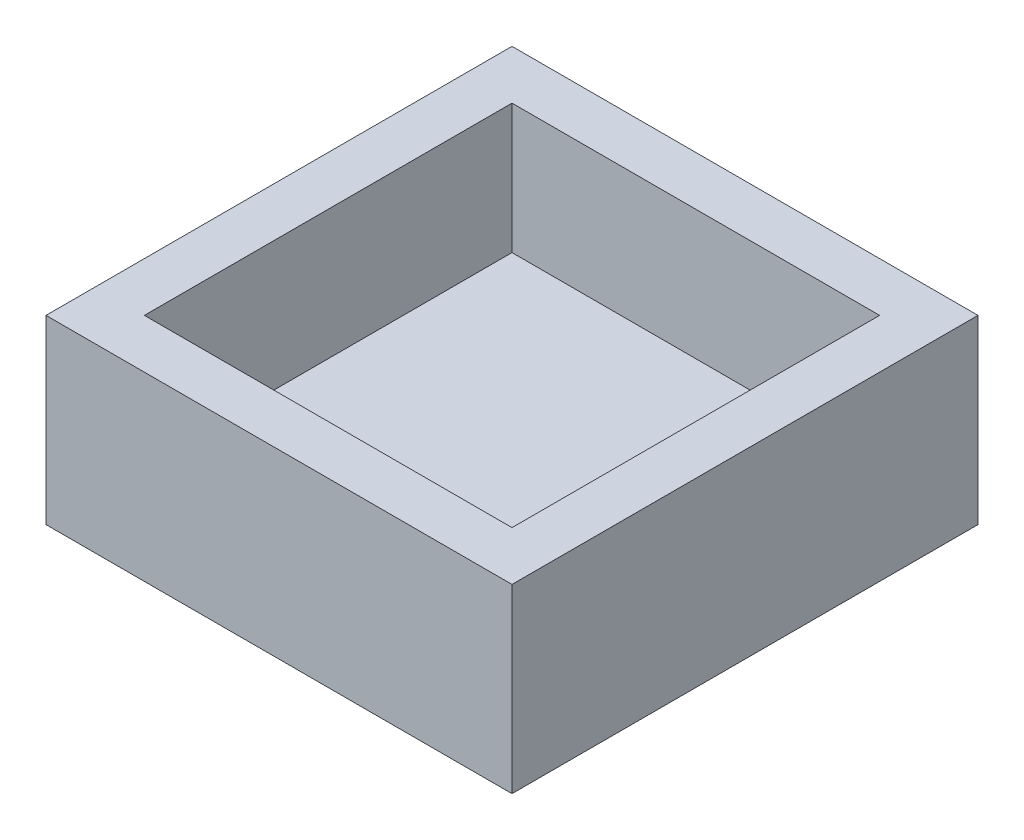
ISO-10303-21;
HEADER;
FILE_DESCRIPTION(('STEP AP214'),'2;1');
FILE_NAME('part.step','',(''),(''),'','','');
FILE_SCHEMA(('AUTOMOTIVE_DESIGN { 1 0 10303 214 1 1 1 1 }'));
ENDSEC;
DATA;
#1=APPLICATION_CONTEXT('core data for automotive mechanical design processes');
#2=APPLICATION_PROTOCOL_DEFINITION('international standard','automotive_design',2000,#1);
#3=PRODUCT_CONTEXT('',#1,'mechanical');
#4=PRODUCT('Part','Part','',(#3));
#5=PRODUCT_RELATED_PRODUCT_CATEGORY('part','',(#4));
#6=PRODUCT_DEFINITION_FORMATION('','',#4);
#7=PRODUCT_DEFINITION_CONTEXT('part definition',#1,'design');
#8=PRODUCT_DEFINITION('design','',#6,#7);
#9=PRODUCT_DEFINITION_SHAPE('','',#8);
#10=(LENGTH_UNIT() NAMED_UNIT(*) SI_UNIT(.MILLI.,.METRE.));
#11=(NAMED_UNIT(*) PLANE_ANGLE_UNIT() SI_UNIT($,.RADIAN.));
#12=(NAMED_UNIT(*) SI_UNIT($,.STERADIAN.) SOLID_ANGLE_UNIT());
#13=UNCERTAINTY_MEASURE_WITH_UNIT(LENGTH_MEASURE(1.E-05),#10,'distance_accuracy_value','');
#14=(GEOMETRIC_REPRESENTATION_CONTEXT(3) GLOBAL_UNCERTAINTY_ASSIGNED_CONTEXT((#13)) GLOBAL_UNIT_ASSIGNED_CONTEXT((#10,
#11,#12)) REPRESENTATION_CONTEXT('',''));
#15=CARTESIAN_POINT('',(0.,0.,0.));
#16=DIRECTION('',(0.,0.,1.));
#17=DIRECTION('',(1.,0.,0.));
#18=AXIS2_PLACEMENT_3D('',#15,#16,#17);
#19=CARTESIAN_POINT('',(9.,7.,9.));
#20=DIRECTION('',(-1.,0.,0.));
#21=DIRECTION('',(0.,0.,1.));
#22=AXIS2_PLACEMENT_3D('',#19,#20,#21);
#23=PLANE('',#22);
#24=DIRECTION('',(0.,0.,-1.));
#25=VECTOR('',#24,1.);
#26=CARTESIAN_POINT('',(9.,0.,9.));
#27=LINE('',#26,#25);
#28=CARTESIAN_POINT('',(9.,0.,9.));
#29=VERTEX_POINT('',#28);
#30=CARTESIAN_POINT('',(9.,0.,-9.));
#31=VERTEX_POINT('',#30);
#32=EDGE_CURVE('E140',#29,#31,#27,.T.);
#33=ORIENTED_EDGE('',*,*,#32,.T.);
#34=DIRECTION('',(0.,-1.,0.));
#35=VECTOR('',#34,1.);
#36=CARTESIAN_POINT('',(9.,7.,-9.));
#37=LINE('',#36,#35);
#38=CARTESIAN_POINT('',(9.,7.,-9.));
#39=VERTEX_POINT('',#38);
#40=EDGE_CURVE('E11',#39,#31,#37,.T.);
#41=ORIENTED_EDGE('',*,*,#40,.F.);
#42=DIRECTION('',(0.,0.,-1.));
#43=VECTOR('',#42,1.);
#44=CARTESIAN_POINT('',(9.,7.,9.));
#45=LINE('',#44,#43);
#46=CARTESIAN_POINT('',(9.,7.,9.));
#47=VERTEX_POINT('',#46);
#48=EDGE_CURVE('E144',#47,#39,#45,.T.);
#49=ORIENTED_EDGE('',*,*,#48,.F.);
#50=DIRECTION('',(0.,-1.,0.));
#51=VECTOR('',#50,1.);
#52=CARTESIAN_POINT('',(9.,7.,9.));
#53=LINE('',#52,#51);
#54=EDGE_CURVE('E150',#47,#29,#53,.T.);
#55=ORIENTED_EDGE('',*,*,#54,.T.);
#56=EDGE_LOOP('',(#33,#41,#49,#55));
#57=FACE_BOUND('',#56,.T.);
#58=ADVANCED_FACE('F32',(#57),#23,.F.);
#59=CARTESIAN_POINT('',(-9.,7.,-9.));
#60=DIRECTION('',(0.,0.,1.));
#61=DIRECTION('',(1.,0.,0.));
#62=AXIS2_PLACEMENT_3D('',#59,#60,#61);
#63=PLANE('',#62);
#64=DIRECTION('',(-1.,0.,0.));
#65=VECTOR('',#64,1.);
#66=CARTESIAN_POINT('',(-9.,0.,-9.));
#67=LINE('',#66,#65);
#68=CARTESIAN_POINT('',(-9.,0.,-9.));
#69=VERTEX_POINT('',#68);
#70=EDGE_CURVE('E153',#31,#69,#67,.T.);
#71=ORIENTED_EDGE('',*,*,#70,.T.);
#72=DIRECTION('',(0.,-1.,0.));
#73=VECTOR('',#72,1.);
#74=CARTESIAN_POINT('',(-9.,7.,-9.));
#75=LINE('',#74,#73);
#76=CARTESIAN_POINT('',(-9.,7.,-9.));
#77=VERTEX_POINT('',#76);
#78=EDGE_CURVE('E39',#77,#69,#75,.T.);
#79=ORIENTED_EDGE('',*,*,#78,.F.);
#80=DIRECTION('',(-1.,0.,0.));
#81=VECTOR('',#80,1.);
#82=CARTESIAN_POINT('',(-9.,7.,-9.));
#83=LINE('',#82,#81);
#84=EDGE_CURVE('E83',#39,#77,#83,.T.);
#85=ORIENTED_EDGE('',*,*,#84,.F.);
#86=ORIENTED_EDGE('',*,*,#40,.T.);
#87=EDGE_LOOP('',(#71,#79,#85,#86));
#88=FACE_BOUND('',#87,.T.);
#89=ADVANCED_FACE('F182',(#88),#63,.F.);
#90=CARTESIAN_POINT('',(-9.,7.,9.));
#91=DIRECTION('',(1.,0.,0.));
#92=DIRECTION('',(0.,0.,-1.));
#93=AXIS2_PLACEMENT_3D('',#90,#91,#92);
#94=PLANE('',#93);
#95=DIRECTION('',(0.,0.,1.));
#96=VECTOR('',#95,1.);
#97=CARTESIAN_POINT('',(-9.,0.,9.));
#98=LINE('',#97,#96);
#99=CARTESIAN_POINT('',(-9.,0.,9.));
#100=VERTEX_POINT('',#99);
#101=EDGE_CURVE('E155',#69,#100,#98,.T.);
#102=ORIENTED_EDGE('',*,*,#101,.T.);
#103=DIRECTION('',(0.,-1.,0.));
#104=VECTOR('',#103,1.);
#105=CARTESIAN_POINT('',(-9.,7.,9.));
#106=LINE('',#105,#104);
#107=CARTESIAN_POINT('',(-9.,7.,9.));
#108=VERTEX_POINT('',#107);
#109=EDGE_CURVE('E159',#108,#100,#106,.T.);
#110=ORIENTED_EDGE('',*,*,#109,.F.);
#111=DIRECTION('',(0.,0.,1.));
#112=VECTOR('',#111,1.);
#113=CARTESIAN_POINT('',(-9.,7.,9.));
#114=LINE('',#113,#112);
#115=EDGE_CURVE('E147',#77,#108,#114,.T.);
#116=ORIENTED_EDGE('',*,*,#115,.F.);
#117=ORIENTED_EDGE('',*,*,#78,.T.);
#118=EDGE_LOOP('',(#102,#110,#116,#117));
#119=FACE_BOUND('',#118,.T.);
#120=ADVANCED_FACE('F164',(#119),#94,.F.);
#121=CARTESIAN_POINT('',(-9.,7.,9.));
#122=DIRECTION('',(0.,0.,-1.));
#123=DIRECTION('',(-1.,0.,0.));
#124=AXIS2_PLACEMENT_3D('',#121,#122,#123);
#125=PLANE('',#124);
#126=DIRECTION('',(1.,0.,0.));
#127=VECTOR('',#126,1.);
#128=CARTESIAN_POINT('',(-9.,0.,9.));
#129=LINE('',#128,#127);
#130=EDGE_CURVE('E76',#100,#29,#129,.T.);
#131=ORIENTED_EDGE('',*,*,#130,.T.);
#132=ORIENTED_EDGE('',*,*,#54,.F.);
#133=DIRECTION('',(1.,0.,0.));
#134=VECTOR('',#133,1.);
#135=CARTESIAN_POINT('',(-9.,7.,9.));
#136=LINE('',#135,#134);
#137=EDGE_CURVE('E55',#108,#47,#136,.T.);
#138=ORIENTED_EDGE('',*,*,#137,.F.);
#139=ORIENTED_EDGE('',*,*,#109,.T.);
#140=EDGE_LOOP('',(#131,#132,#138,#139));
#141=FACE_BOUND('',#140,.T.);
#142=ADVANCED_FACE('F172',(#141),#125,.F.);
#143=CARTESIAN_POINT('',(0.,7.,0.));
#144=DIRECTION('',(0.,-1.,0.));
#145=DIRECTION('',(0.,0.,-1.));
#146=AXIS2_PLACEMENT_3D('',#143,#144,#145);
#147=PLANE('',#146);
#148=DIRECTION('',(-1.,0.,0.));
#149=VECTOR('',#148,1.);
#150=CARTESIAN_POINT('',(-7.1,7.,-7.1));
#151=LINE('',#150,#149);
#152=CARTESIAN_POINT('',(7.1,7.,-7.1));
#153=VERTEX_POINT('',#152);
#154=CARTESIAN_POINT('',(-7.1,7.,-7.1));
#155=VERTEX_POINT('',#154);
#156=EDGE_CURVE('E134',#153,#155,#151,.T.);
#157=ORIENTED_EDGE('',*,*,#156,.F.);
#158=DIRECTION('',(0.,0.,-1.));
#159=VECTOR('',#158,1.);
#160=CARTESIAN_POINT('',(7.1,7.,-7.1));
#161=LINE('',#160,#159);
#162=CARTESIAN_POINT('',(7.1,7.,7.1));
#163=VERTEX_POINT('',#162);
#164=EDGE_CURVE('E46',#163,#153,#161,.T.);
#165=ORIENTED_EDGE('',*,*,#164,.F.);
#166=DIRECTION('',(1.,0.,0.));
#167=VECTOR('',#166,1.);
#168=CARTESIAN_POINT('',(-7.1,7.,7.1));
#169=LINE('',#168,#167);
#170=CARTESIAN_POINT('',(-7.1,7.,7.1));
#171=VERTEX_POINT('',#170);
#172=EDGE_CURVE('E125',#171,#163,#169,.T.);
#173=ORIENTED_EDGE('',*,*,#172,.F.);
#174=DIRECTION('',(0.,0.,1.));
#175=VECTOR('',#174,1.);
#176=CARTESIAN_POINT('',(-7.1,7.,-7.1));
#177=LINE('',#176,#175);
#178=EDGE_CURVE('E128',#155,#171,#177,.T.);
#179=ORIENTED_EDGE('',*,*,#178,.F.);
#180=EDGE_LOOP('',(#157,#165,#173,#179));
#181=FACE_BOUND('',#180,.T.);
#182=ORIENTED_EDGE('',*,*,#48,.T.);
#183=ORIENTED_EDGE('',*,*,#84,.T.);
#184=ORIENTED_EDGE('',*,*,#115,.T.);
#185=ORIENTED_EDGE('',*,*,#137,.T.);
#186=EDGE_LOOP('',(#182,#183,#184,#185));
#187=FACE_BOUND('',#186,.T.);
#188=ADVANCED_FACE('F174',(#181,#187),#147,.F.);
#189=CARTESIAN_POINT('',(0.,0.,0.));
#190=DIRECTION('',(0.,-1.,0.));
#191=DIRECTION('',(0.,0.,-1.));
#192=AXIS2_PLACEMENT_3D('',#189,#190,#191);
#193=PLANE('',#192);
#194=ORIENTED_EDGE('',*,*,#32,.F.);
#195=ORIENTED_EDGE('',*,*,#130,.F.);
#196=ORIENTED_EDGE('',*,*,#101,.F.);
#197=ORIENTED_EDGE('',*,*,#70,.F.);
#198=EDGE_LOOP('',(#194,#195,#196,#197));
#199=FACE_BOUND('',#198,.T.);
#200=ADVANCED_FACE('F168',(#199),#193,.T.);
#201=CARTESIAN_POINT('',(7.1,2.,-7.1));
#202=DIRECTION('',(1.,0.,0.));
#203=DIRECTION('',(0.,0.,-1.));
#204=AXIS2_PLACEMENT_3D('',#201,#202,#203);
#205=PLANE('',#204);
#206=ORIENTED_EDGE('',*,*,#164,.T.);
#207=DIRECTION('',(0.,1.,0.));
#208=VECTOR('',#207,1.);
#209=CARTESIAN_POINT('',(7.1,2.,-7.1));
#210=LINE('',#209,#208);
#211=CARTESIAN_POINT('',(7.1,2.,-7.1));
#212=VERTEX_POINT('',#211);
#213=EDGE_CURVE('E103',#212,#153,#210,.T.);
#214=ORIENTED_EDGE('',*,*,#213,.F.);
#215=DIRECTION('',(0.,0.,-1.));
#216=VECTOR('',#215,1.);
#217=CARTESIAN_POINT('',(7.1,2.,-7.1));
#218=LINE('',#217,#216);
#219=CARTESIAN_POINT('',(7.1,2.,7.1));
#220=VERTEX_POINT('',#219);
#221=EDGE_CURVE('E107',#220,#212,#218,.T.);
#222=ORIENTED_EDGE('',*,*,#221,.F.);
#223=DIRECTION('',(0.,1.,0.));
#224=VECTOR('',#223,1.);
#225=CARTESIAN_POINT('',(7.1,2.,7.1));
#226=LINE('',#225,#224);
#227=EDGE_CURVE('E138',#220,#163,#226,.T.);
#228=ORIENTED_EDGE('',*,*,#227,.T.);
#229=EDGE_LOOP('',(#206,#214,#222,#228));
#230=FACE_BOUND('',#229,.T.);
#231=ADVANCED_FACE('F105',(#230),#205,.F.);
#232=CARTESIAN_POINT('',(-7.1,2.,7.1));
#233=DIRECTION('',(0.,0.,1.));
#234=DIRECTION('',(1.,0.,0.));
#235=AXIS2_PLACEMENT_3D('',#232,#233,#234);
#236=PLANE('',#235);
#237=ORIENTED_EDGE('',*,*,#172,.T.);
#238=ORIENTED_EDGE('',*,*,#227,.F.);
#239=DIRECTION('',(1.,0.,0.));
#240=VECTOR('',#239,1.);
#241=CARTESIAN_POINT('',(-7.1,2.,7.1));
#242=LINE('',#241,#240);
#243=CARTESIAN_POINT('',(-7.1,2.,7.1));
#244=VERTEX_POINT('',#243);
#245=EDGE_CURVE('E113',#244,#220,#242,.T.);
#246=ORIENTED_EDGE('',*,*,#245,.F.);
#247=DIRECTION('',(0.,1.,0.));
#248=VECTOR('',#247,1.);
#249=CARTESIAN_POINT('',(-7.1,2.,7.1));
#250=LINE('',#249,#248);
#251=EDGE_CURVE('E141',#244,#171,#250,.T.);
#252=ORIENTED_EDGE('',*,*,#251,.T.);
#253=EDGE_LOOP('',(#237,#238,#246,#252));
#254=FACE_BOUND('',#253,.T.);
#255=ADVANCED_FACE('F221',(#254),#236,.F.);
#256=CARTESIAN_POINT('',(-7.1,2.,-7.1));
#257=DIRECTION('',(-1.,0.,0.));
#258=DIRECTION('',(0.,0.,1.));
#259=AXIS2_PLACEMENT_3D('',#256,#257,#258);
#260=PLANE('',#259);
#261=ORIENTED_EDGE('',*,*,#178,.T.);
#262=ORIENTED_EDGE('',*,*,#251,.F.);
#263=DIRECTION('',(0.,0.,1.));
#264=VECTOR('',#263,1.);
#265=CARTESIAN_POINT('',(-7.1,2.,-7.1));
#266=LINE('',#265,#264);
#267=CARTESIAN_POINT('',(-7.1,2.,-7.1));
#268=VERTEX_POINT('',#267);
#269=EDGE_CURVE('E121',#268,#244,#266,.T.);
#270=ORIENTED_EDGE('',*,*,#269,.F.);
#271=DIRECTION('',(0.,1.,0.));
#272=VECTOR('',#271,1.);
#273=CARTESIAN_POINT('',(-7.1,2.,-7.1));
#274=LINE('',#273,#272);
#275=EDGE_CURVE('E112',#268,#155,#274,.T.);
#276=ORIENTED_EDGE('',*,*,#275,.T.);
#277=EDGE_LOOP('',(#261,#262,#270,#276));
#278=FACE_BOUND('',#277,.T.);
#279=ADVANCED_FACE('F230',(#278),#260,.F.);
#280=CARTESIAN_POINT('',(-7.1,2.,-7.1));
#281=DIRECTION('',(0.,0.,-1.));
#282=DIRECTION('',(-1.,0.,0.));
#283=AXIS2_PLACEMENT_3D('',#280,#281,#282);
#284=PLANE('',#283);
#285=ORIENTED_EDGE('',*,*,#156,.T.);
#286=ORIENTED_EDGE('',*,*,#275,.F.);
#287=DIRECTION('',(-1.,0.,0.));
#288=VECTOR('',#287,1.);
#289=CARTESIAN_POINT('',(-7.1,2.,-7.1));
#290=LINE('',#289,#288);
#291=EDGE_CURVE('E116',#212,#268,#290,.T.);
#292=ORIENTED_EDGE('',*,*,#291,.F.);
#293=ORIENTED_EDGE('',*,*,#213,.T.);
#294=EDGE_LOOP('',(#285,#286,#292,#293));
#295=FACE_BOUND('',#294,.T.);
#296=ADVANCED_FACE('F117',(#295),#284,.F.);
#297=CARTESIAN_POINT('',(0.,2.,0.));
#298=DIRECTION('',(0.,1.,0.));
#299=DIRECTION('',(0.,0.,1.));
#300=AXIS2_PLACEMENT_3D('',#297,#298,#299);
#301=PLANE('',#300);
#302=ORIENTED_EDGE('',*,*,#221,.T.);
#303=ORIENTED_EDGE('',*,*,#291,.T.);
#304=ORIENTED_EDGE('',*,*,#269,.T.);
#305=ORIENTED_EDGE('',*,*,#245,.T.);
#306=EDGE_LOOP('',(#302,#303,#304,#305));
#307=FACE_BOUND('',#306,.T.);
#308=ADVANCED_FACE('F123',(#307),#301,.T.);
#309=CLOSED_SHELL('',(#58,#89,#120,#142,#188,#200,#231,#255,#279,#296,#308));
#310=MANIFOLD_SOLID_BREP('B2',#309);
#311=ADVANCED_BREP_SHAPE_REPRESENTATION('',(#18,#310),#14);
#312=SHAPE_DEFINITION_REPRESENTATION(#9,#311);
ENDSEC;
END-ISO-10303-21;
